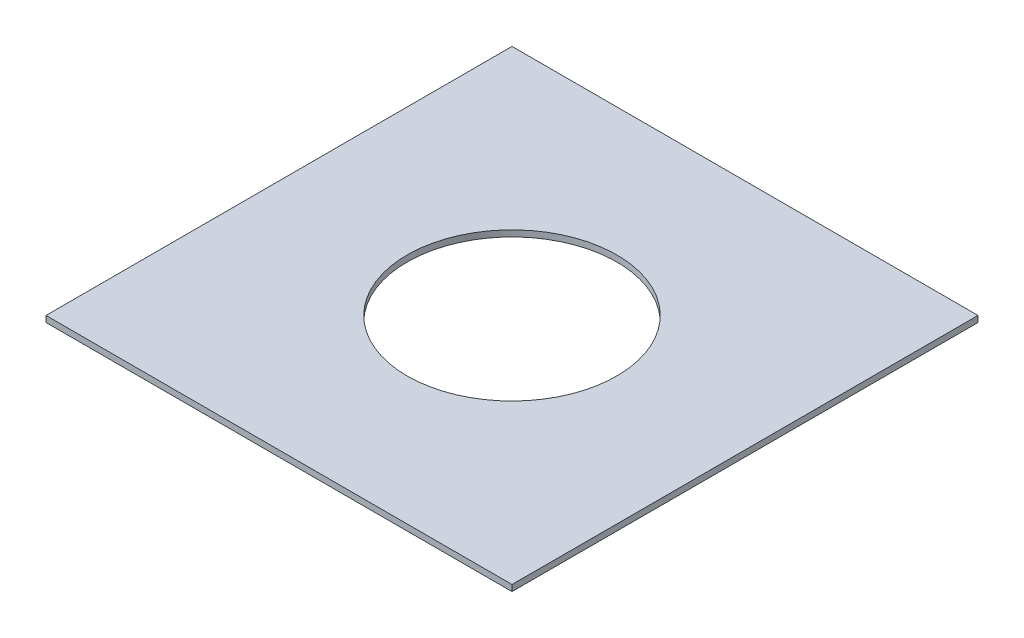
ISO-10303-21;
HEADER;
FILE_DESCRIPTION(('STEP AP214'),'2;1');
FILE_NAME('part.step','',(''),(''),'','','');
FILE_SCHEMA(('AUTOMOTIVE_DESIGN { 1 0 10303 214 1 1 1 1 }'));
ENDSEC;
DATA;
#1=APPLICATION_CONTEXT('core data for automotive mechanical design processes');
#2=APPLICATION_PROTOCOL_DEFINITION('international standard','automotive_design',2000,#1);
#3=PRODUCT_CONTEXT('',#1,'mechanical');
#4=PRODUCT('Part','Part','',(#3));
#5=PRODUCT_RELATED_PRODUCT_CATEGORY('part','',(#4));
#6=PRODUCT_DEFINITION_FORMATION('','',#4);
#7=PRODUCT_DEFINITION_CONTEXT('part definition',#1,'design');
#8=PRODUCT_DEFINITION('design','',#6,#7);
#9=PRODUCT_DEFINITION_SHAPE('','',#8);
#10=(LENGTH_UNIT() NAMED_UNIT(*) SI_UNIT(.MILLI.,.METRE.));
#11=(NAMED_UNIT(*) PLANE_ANGLE_UNIT() SI_UNIT($,.RADIAN.));
#12=(NAMED_UNIT(*) SI_UNIT($,.STERADIAN.) SOLID_ANGLE_UNIT());
#13=UNCERTAINTY_MEASURE_WITH_UNIT(LENGTH_MEASURE(1.E-05),#10,'distance_accuracy_value','');
#14=(GEOMETRIC_REPRESENTATION_CONTEXT(3) GLOBAL_UNCERTAINTY_ASSIGNED_CONTEXT((#13)) GLOBAL_UNIT_ASSIGNED_CONTEXT((#10,
#11,#12)) REPRESENTATION_CONTEXT('',''));
#15=CARTESIAN_POINT('',(0.,0.,0.));
#16=DIRECTION('',(0.,0.,1.));
#17=DIRECTION('',(1.,0.,0.));
#18=AXIS2_PLACEMENT_3D('',#15,#16,#17);
#19=CARTESIAN_POINT('',(0.,0.79375,0.));
#20=DIRECTION('',(0.,1.,0.));
#21=DIRECTION('',(0.,0.,1.));
#22=AXIS2_PLACEMENT_3D('',#19,#20,#21);
#23=PLANE('',#22);
#24=DIRECTION('',(-1.,0.,0.));
#25=VECTOR('',#24,1.);
#26=CARTESIAN_POINT('',(17.557337307224,0.79375,-30.5401810731712));
#27=LINE('',#26,#25);
#28=CARTESIAN_POINT('',(77.557337307224,0.79375,-30.5401810731712));
#29=VERTEX_POINT('',#28);
#30=CARTESIAN_POINT('',(17.557337307224,0.79375,-30.5401810731712));
#31=VERTEX_POINT('',#30);
#32=EDGE_CURVE('E91',#29,#31,#27,.T.);
#33=ORIENTED_EDGE('',*,*,#32,.T.);
#34=DIRECTION('',(0.,0.,1.));
#35=VECTOR('',#34,1.);
#36=CARTESIAN_POINT('',(17.557337307224,0.79375,-30.5401810731712));
#37=LINE('',#36,#35);
#38=CARTESIAN_POINT('',(17.557337307224,0.79375,29.4598189268288));
#39=VERTEX_POINT('',#38);
#40=EDGE_CURVE('E86',#31,#39,#37,.T.);
#41=ORIENTED_EDGE('',*,*,#40,.T.);
#42=DIRECTION('',(1.,0.,0.));
#43=VECTOR('',#42,1.);
#44=CARTESIAN_POINT('',(17.557337307224,0.79375,29.4598189268288));
#45=LINE('',#44,#43);
#46=CARTESIAN_POINT('',(77.557337307224,0.79375,29.4598189268288));
#47=VERTEX_POINT('',#46);
#48=EDGE_CURVE('E89',#39,#47,#45,.T.);
#49=ORIENTED_EDGE('',*,*,#48,.T.);
#50=DIRECTION('',(0.,0.,-1.));
#51=VECTOR('',#50,1.);
#52=CARTESIAN_POINT('',(77.557337307224,0.79375,29.4598189268288));
#53=LINE('',#52,#51);
#54=EDGE_CURVE('E56',#47,#29,#53,.T.);
#55=ORIENTED_EDGE('',*,*,#54,.T.);
#56=EDGE_LOOP('',(#33,#41,#49,#55));
#57=FACE_BOUND('',#56,.T.);
#58=CARTESIAN_POINT('',(47.557337307224,0.79375,-0.540181073171234));
#59=DIRECTION('',(0.,1.,0.));
#60=DIRECTION('',(0.,0.,1.));
#61=AXIS2_PLACEMENT_3D('',#58,#59,#60);
#62=CIRCLE('',#61,13.5);
#63=CARTESIAN_POINT('',(47.557337307224,0.79375,12.9598189268288));
#64=VERTEX_POINT('',#63);
#65=EDGE_CURVE('E106',#64,#64,#62,.T.);
#66=ORIENTED_EDGE('',*,*,#65,.F.);
#67=EDGE_LOOP('',(#66));
#68=FACE_BOUND('',#67,.T.);
#69=ADVANCED_FACE('F39',(#57,#68),#23,.T.);
#70=CARTESIAN_POINT('',(0.,0.,0.));
#71=DIRECTION('',(0.,1.,0.));
#72=DIRECTION('',(0.,0.,1.));
#73=AXIS2_PLACEMENT_3D('',#70,#71,#72);
#74=PLANE('',#73);
#75=DIRECTION('',(-1.,0.,0.));
#76=VECTOR('',#75,1.);
#77=CARTESIAN_POINT('',(17.557337307224,0.,-30.5401810731712));
#78=LINE('',#77,#76);
#79=CARTESIAN_POINT('',(77.557337307224,0.,-30.5401810731712));
#80=VERTEX_POINT('',#79);
#81=CARTESIAN_POINT('',(17.557337307224,0.,-30.5401810731712));
#82=VERTEX_POINT('',#81);
#83=EDGE_CURVE('E103',#80,#82,#78,.T.);
#84=ORIENTED_EDGE('',*,*,#83,.F.);
#85=DIRECTION('',(0.,0.,-1.));
#86=VECTOR('',#85,1.);
#87=CARTESIAN_POINT('',(77.557337307224,0.,29.4598189268288));
#88=LINE('',#87,#86);
#89=CARTESIAN_POINT('',(77.557337307224,0.,29.4598189268288));
#90=VERTEX_POINT('',#89);
#91=EDGE_CURVE('E79',#90,#80,#88,.T.);
#92=ORIENTED_EDGE('',*,*,#91,.F.);
#93=DIRECTION('',(1.,0.,0.));
#94=VECTOR('',#93,1.);
#95=CARTESIAN_POINT('',(17.557337307224,0.,29.4598189268288));
#96=LINE('',#95,#94);
#97=CARTESIAN_POINT('',(17.557337307224,0.,29.4598189268288));
#98=VERTEX_POINT('',#97);
#99=EDGE_CURVE('E73',#98,#90,#96,.T.);
#100=ORIENTED_EDGE('',*,*,#99,.F.);
#101=DIRECTION('',(0.,0.,1.));
#102=VECTOR('',#101,1.);
#103=CARTESIAN_POINT('',(17.557337307224,0.,-30.5401810731712));
#104=LINE('',#103,#102);
#105=EDGE_CURVE('E95',#82,#98,#104,.T.);
#106=ORIENTED_EDGE('',*,*,#105,.F.);
#107=EDGE_LOOP('',(#84,#92,#100,#106));
#108=FACE_BOUND('',#107,.T.);
#109=CARTESIAN_POINT('',(47.557337307224,0.,-0.540181073171234));
#110=DIRECTION('',(0.,1.,0.));
#111=DIRECTION('',(0.,0.,1.));
#112=AXIS2_PLACEMENT_3D('',#109,#110,#111);
#113=CIRCLE('',#112,13.5);
#114=CARTESIAN_POINT('',(47.557337307224,0.,12.9598189268288));
#115=VERTEX_POINT('',#114);
#116=EDGE_CURVE('E118',#115,#115,#113,.T.);
#117=ORIENTED_EDGE('',*,*,#116,.T.);
#118=EDGE_LOOP('',(#117));
#119=FACE_BOUND('',#118,.T.);
#120=ADVANCED_FACE('F114',(#108,#119),#74,.F.);
#121=CARTESIAN_POINT('',(17.557337307224,0.79375,-30.5401810731712));
#122=DIRECTION('',(0.,0.,1.));
#123=DIRECTION('',(1.,0.,0.));
#124=AXIS2_PLACEMENT_3D('',#121,#122,#123);
#125=PLANE('',#124);
#126=ORIENTED_EDGE('',*,*,#83,.T.);
#127=DIRECTION('',(0.,-1.,0.));
#128=VECTOR('',#127,1.);
#129=CARTESIAN_POINT('',(17.557337307224,0.79375,-30.5401810731712));
#130=LINE('',#129,#128);
#131=EDGE_CURVE('E11',#31,#82,#130,.T.);
#132=ORIENTED_EDGE('',*,*,#131,.F.);
#133=ORIENTED_EDGE('',*,*,#32,.F.);
#134=DIRECTION('',(0.,-1.,0.));
#135=VECTOR('',#134,1.);
#136=CARTESIAN_POINT('',(77.557337307224,0.79375,-30.5401810731712));
#137=LINE('',#136,#135);
#138=EDGE_CURVE('E99',#29,#80,#137,.T.);
#139=ORIENTED_EDGE('',*,*,#138,.T.);
#140=EDGE_LOOP('',(#126,#132,#133,#139));
#141=FACE_BOUND('',#140,.T.);
#142=ADVANCED_FACE('F41',(#141),#125,.F.);
#143=CARTESIAN_POINT('',(17.557337307224,0.79375,-30.5401810731712));
#144=DIRECTION('',(1.,0.,0.));
#145=DIRECTION('',(0.,0.,-1.));
#146=AXIS2_PLACEMENT_3D('',#143,#144,#145);
#147=PLANE('',#146);
#148=ORIENTED_EDGE('',*,*,#105,.T.);
#149=DIRECTION('',(0.,-1.,0.));
#150=VECTOR('',#149,1.);
#151=CARTESIAN_POINT('',(17.557337307224,0.79375,29.4598189268288));
#152=LINE('',#151,#150);
#153=EDGE_CURVE('E48',#39,#98,#152,.T.);
#154=ORIENTED_EDGE('',*,*,#153,.F.);
#155=ORIENTED_EDGE('',*,*,#40,.F.);
#156=ORIENTED_EDGE('',*,*,#131,.T.);
#157=EDGE_LOOP('',(#148,#154,#155,#156));
#158=FACE_BOUND('',#157,.T.);
#159=ADVANCED_FACE('F94',(#158),#147,.F.);
#160=CARTESIAN_POINT('',(17.557337307224,0.79375,29.4598189268288));
#161=DIRECTION('',(0.,0.,-1.));
#162=DIRECTION('',(-1.,0.,0.));
#163=AXIS2_PLACEMENT_3D('',#160,#161,#162);
#164=PLANE('',#163);
#165=ORIENTED_EDGE('',*,*,#99,.T.);
#166=DIRECTION('',(0.,-1.,0.));
#167=VECTOR('',#166,1.);
#168=CARTESIAN_POINT('',(77.557337307224,0.79375,29.4598189268288));
#169=LINE('',#168,#167);
#170=EDGE_CURVE('E96',#47,#90,#169,.T.);
#171=ORIENTED_EDGE('',*,*,#170,.F.);
#172=ORIENTED_EDGE('',*,*,#48,.F.);
#173=ORIENTED_EDGE('',*,*,#153,.T.);
#174=EDGE_LOOP('',(#165,#171,#172,#173));
#175=FACE_BOUND('',#174,.T.);
#176=ADVANCED_FACE('F97',(#175),#164,.F.);
#177=CARTESIAN_POINT('',(77.557337307224,0.79375,29.4598189268288));
#178=DIRECTION('',(-1.,0.,0.));
#179=DIRECTION('',(0.,0.,1.));
#180=AXIS2_PLACEMENT_3D('',#177,#178,#179);
#181=PLANE('',#180);
#182=ORIENTED_EDGE('',*,*,#91,.T.);
#183=ORIENTED_EDGE('',*,*,#138,.F.);
#184=ORIENTED_EDGE('',*,*,#54,.F.);
#185=ORIENTED_EDGE('',*,*,#170,.T.);
#186=EDGE_LOOP('',(#182,#183,#184,#185));
#187=FACE_BOUND('',#186,.T.);
#188=ADVANCED_FACE('F111',(#187),#181,.F.);
#189=CARTESIAN_POINT('',(47.557337307224,0.79375,-0.540181073171234));
#190=DIRECTION('',(0.,-1.,0.));
#191=DIRECTION('',(0.,0.,-1.));
#192=AXIS2_PLACEMENT_3D('',#189,#190,#191);
#193=CYLINDRICAL_SURFACE('',#192,13.5);
#194=ORIENTED_EDGE('',*,*,#65,.T.);
#195=EDGE_LOOP('',(#194));
#196=FACE_BOUND('',#195,.T.);
#197=ORIENTED_EDGE('',*,*,#116,.F.);
#198=EDGE_LOOP('',(#197));
#199=FACE_BOUND('',#198,.T.);
#200=ADVANCED_FACE('F124',(#196,#199),#193,.F.);
#201=CLOSED_SHELL('',(#69,#120,#142,#159,#176,#188,#200));
#202=MANIFOLD_SOLID_BREP('B2',#201);
#203=ADVANCED_BREP_SHAPE_REPRESENTATION('',(#18,#202),#14);
#204=SHAPE_DEFINITION_REPRESENTATION(#9,#203);
ENDSEC;
END-ISO-10303-21;
